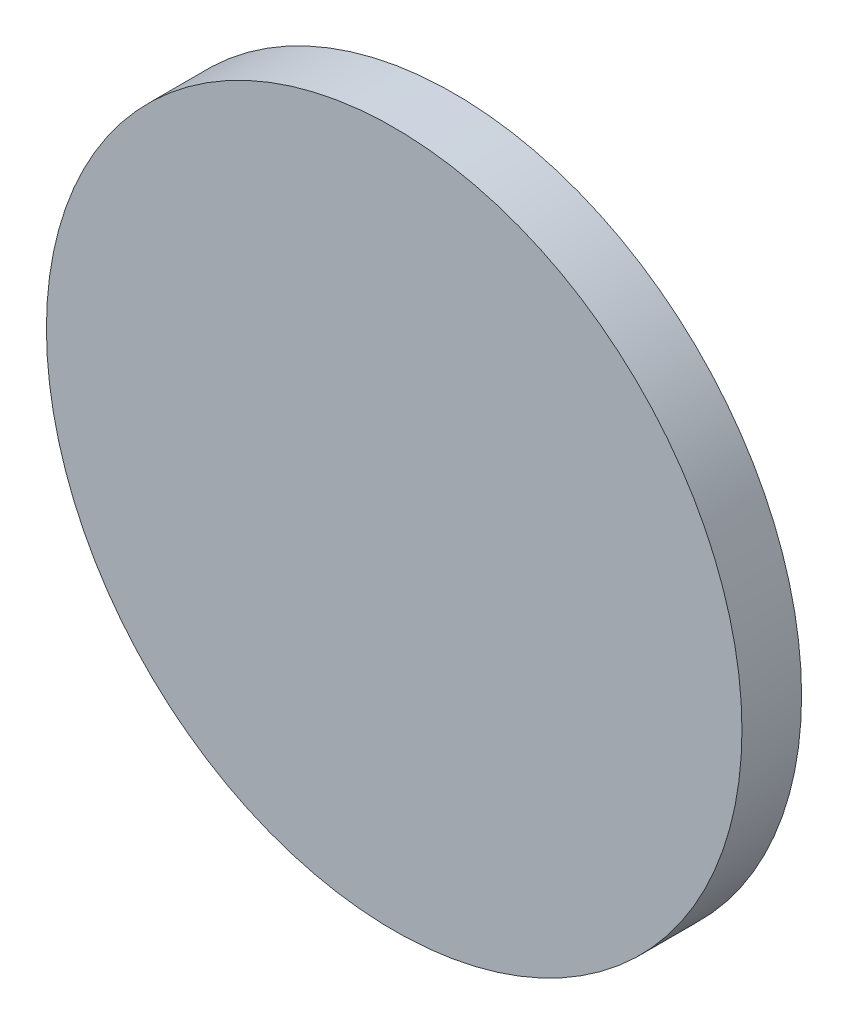
ISO-10303-21;
HEADER;
FILE_DESCRIPTION(('STEP AP214'),'2;1');
FILE_NAME('part.step','',(''),(''),'','','');
FILE_SCHEMA(('AUTOMOTIVE_DESIGN { 1 0 10303 214 1 1 1 1 }'));
ENDSEC;
DATA;
#1=APPLICATION_CONTEXT('core data for automotive mechanical design processes');
#2=APPLICATION_PROTOCOL_DEFINITION('international standard','automotive_design',2000,#1);
#3=PRODUCT_CONTEXT('',#1,'mechanical');
#4=PRODUCT('Part','Part','',(#3));
#5=PRODUCT_RELATED_PRODUCT_CATEGORY('part','',(#4));
#6=PRODUCT_DEFINITION_FORMATION('','',#4);
#7=PRODUCT_DEFINITION_CONTEXT('part definition',#1,'design');
#8=PRODUCT_DEFINITION('design','',#6,#7);
#9=PRODUCT_DEFINITION_SHAPE('','',#8);
#10=(LENGTH_UNIT() NAMED_UNIT(*) SI_UNIT(.MILLI.,.METRE.));
#11=(NAMED_UNIT(*) PLANE_ANGLE_UNIT() SI_UNIT($,.RADIAN.));
#12=(NAMED_UNIT(*) SI_UNIT($,.STERADIAN.) SOLID_ANGLE_UNIT());
#13=UNCERTAINTY_MEASURE_WITH_UNIT(LENGTH_MEASURE(1.E-05),#10,'distance_accuracy_value','');
#14=(GEOMETRIC_REPRESENTATION_CONTEXT(3) GLOBAL_UNCERTAINTY_ASSIGNED_CONTEXT((#13)) GLOBAL_UNIT_ASSIGNED_CONTEXT((#10,
#11,#12)) REPRESENTATION_CONTEXT('',''));
#15=CARTESIAN_POINT('',(0.,0.,0.));
#16=DIRECTION('',(0.,0.,1.));
#17=DIRECTION('',(1.,0.,0.));
#18=AXIS2_PLACEMENT_3D('',#15,#16,#17);
#19=CARTESIAN_POINT('',(2.19964,7.599680006176,0.76487));
#20=DIRECTION('',(0.,0.,-1.));
#21=DIRECTION('',(-1.,0.,0.));
#22=AXIS2_PLACEMENT_3D('',#19,#20,#21);
#23=PLANE('',#22);
#24=CARTESIAN_POINT('',(2.19964,7.599680006176,0.76487));
#25=DIRECTION('',(0.,0.,1.));
#26=DIRECTION('',(1.,0.,0.));
#27=AXIS2_PLACEMENT_3D('',#24,#25,#26);
#28=CIRCLE('',#27,0.200024667);
#29=CARTESIAN_POINT('',(2.399664667,7.599680006176,0.76487));
#30=VERTEX_POINT('',#29);
#31=EDGE_CURVE('E18',#30,#30,#28,.T.);
#32=ORIENTED_EDGE('',*,*,#31,.F.);
#33=EDGE_LOOP('',(#32));
#34=FACE_BOUND('',#33,.T.);
#35=ADVANCED_FACE('F15',(#34),#23,.T.);
#36=CARTESIAN_POINT('',(2.19964,7.599680006176,0.76487));
#37=DIRECTION('',(0.,0.,1.));
#38=DIRECTION('',(1.,0.,0.));
#39=AXIS2_PLACEMENT_3D('',#36,#37,#38);
#40=CYLINDRICAL_SURFACE('',#39,0.200024667);
#41=CARTESIAN_POINT('',(2.19964,7.599680006176,0.79916));
#42=DIRECTION('',(0.,0.,1.));
#43=DIRECTION('',(1.,0.,0.));
#44=AXIS2_PLACEMENT_3D('',#41,#42,#43);
#45=CIRCLE('',#44,0.200024667);
#46=CARTESIAN_POINT('',(2.399664667,7.599680006176,0.79916));
#47=VERTEX_POINT('',#46);
#48=EDGE_CURVE('E10',#47,#47,#45,.T.);
#49=ORIENTED_EDGE('',*,*,#48,.F.);
#50=EDGE_LOOP('',(#49));
#51=FACE_BOUND('',#50,.T.);
#52=ORIENTED_EDGE('',*,*,#31,.T.);
#53=EDGE_LOOP('',(#52));
#54=FACE_BOUND('',#53,.T.);
#55=ADVANCED_FACE('F27',(#51,#54),#40,.T.);
#56=CARTESIAN_POINT('',(2.19964,7.599680006176,0.79916));
#57=DIRECTION('',(0.,0.,1.));
#58=DIRECTION('',(1.,0.,0.));
#59=AXIS2_PLACEMENT_3D('',#56,#57,#58);
#60=PLANE('',#59);
#61=ORIENTED_EDGE('',*,*,#48,.T.);
#62=EDGE_LOOP('',(#61));
#63=FACE_BOUND('',#62,.T.);
#64=ADVANCED_FACE('F34',(#63),#60,.T.);
#65=CLOSED_SHELL('',(#35,#55,#64));
#66=MANIFOLD_SOLID_BREP('B1',#65);
#67=ADVANCED_BREP_SHAPE_REPRESENTATION('',(#18,#66),#14);
#68=SHAPE_DEFINITION_REPRESENTATION(#9,#67);
ENDSEC;
END-ISO-10303-21;
